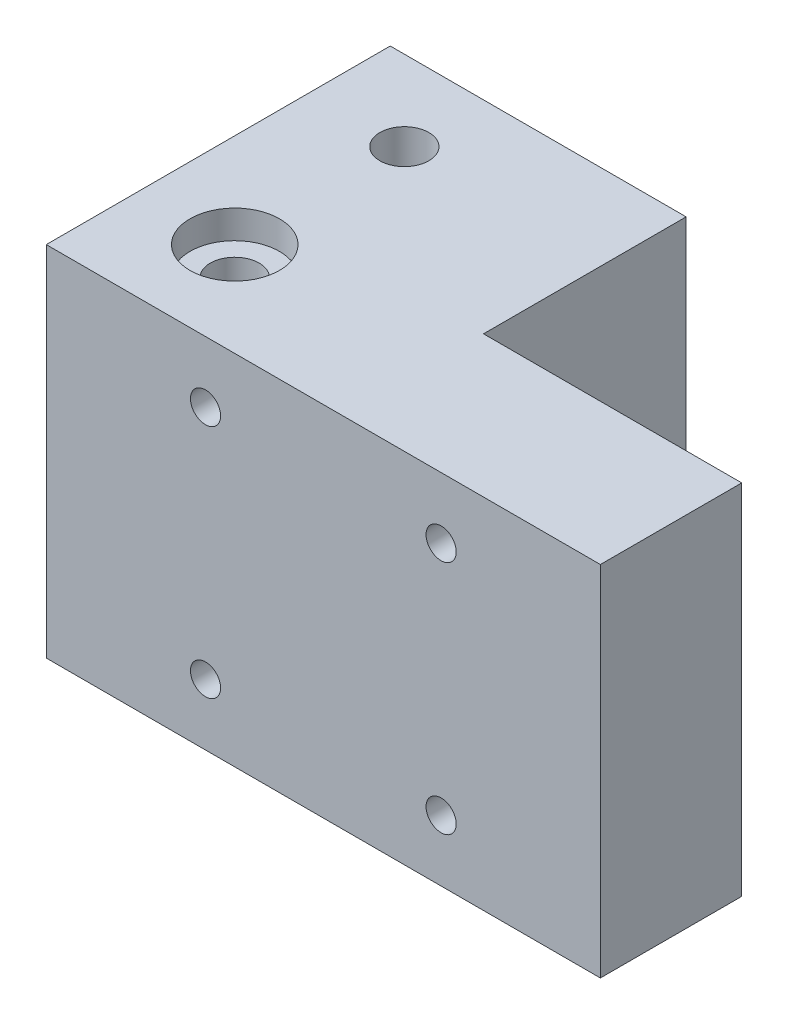
ISO-10303-21;
HEADER;
FILE_DESCRIPTION(('STEP AP214'),'2;1');
FILE_NAME('part.step','',(''),(''),'','','');
FILE_SCHEMA(('AUTOMOTIVE_DESIGN { 1 0 10303 214 1 1 1 1 }'));
ENDSEC;
DATA;
#1=APPLICATION_CONTEXT('core data for automotive mechanical design processes');
#2=APPLICATION_PROTOCOL_DEFINITION('international standard','automotive_design',2000,#1);
#3=PRODUCT_CONTEXT('',#1,'mechanical');
#4=PRODUCT('Part','Part','',(#3));
#5=PRODUCT_RELATED_PRODUCT_CATEGORY('part','',(#4));
#6=PRODUCT_DEFINITION_FORMATION('','',#4);
#7=PRODUCT_DEFINITION_CONTEXT('part definition',#1,'design');
#8=PRODUCT_DEFINITION('design','',#6,#7);
#9=PRODUCT_DEFINITION_SHAPE('','',#8);
#10=(LENGTH_UNIT() NAMED_UNIT(*) SI_UNIT(.MILLI.,.METRE.));
#11=(NAMED_UNIT(*) PLANE_ANGLE_UNIT() SI_UNIT($,.RADIAN.));
#12=(NAMED_UNIT(*) SI_UNIT($,.STERADIAN.) SOLID_ANGLE_UNIT());
#13=UNCERTAINTY_MEASURE_WITH_UNIT(LENGTH_MEASURE(1.E-05),#10,'distance_accuracy_value','');
#14=(GEOMETRIC_REPRESENTATION_CONTEXT(3) GLOBAL_UNCERTAINTY_ASSIGNED_CONTEXT((#13)) GLOBAL_UNIT_ASSIGNED_CONTEXT((#10,
#11,#12)) REPRESENTATION_CONTEXT('',''));
#15=CARTESIAN_POINT('',(0.,0.,0.));
#16=DIRECTION('',(0.,0.,1.));
#17=DIRECTION('',(1.,0.,0.));
#18=AXIS2_PLACEMENT_3D('',#15,#16,#17);
#19=CARTESIAN_POINT('',(-20.1396226415094,-15.9547169811321,31.5));
#20=DIRECTION('',(0.,1.,0.));
#21=DIRECTION('',(0.,0.,1.));
#22=AXIS2_PLACEMENT_3D('',#19,#20,#21);
#23=CYLINDRICAL_SURFACE('',#22,2.6);
#24=CARTESIAN_POINT('',(-20.1396226415094,-15.9547169811321,31.5));
#25=DIRECTION('',(0.,1.,0.));
#26=DIRECTION('',(0.,0.,1.));
#27=AXIS2_PLACEMENT_3D('',#24,#25,#26);
#28=CIRCLE('',#27,2.6);
#29=CARTESIAN_POINT('',(-20.1396226415094,-15.9547169811321,34.1));
#30=VERTEX_POINT('',#29);
#31=EDGE_CURVE('E216',#30,#30,#28,.T.);
#32=ORIENTED_EDGE('',*,*,#31,.F.);
#33=EDGE_LOOP('',(#32));
#34=FACE_BOUND('',#33,.T.);
#35=CARTESIAN_POINT('',(-20.1396226415094,19.0452830188679,31.5));
#36=DIRECTION('',(0.,1.,0.));
#37=DIRECTION('',(0.,0.,1.));
#38=AXIS2_PLACEMENT_3D('',#35,#36,#37);
#39=CIRCLE('',#38,2.6);
#40=CARTESIAN_POINT('',(-20.1396226415094,19.0452830188679,34.1));
#41=VERTEX_POINT('',#40);
#42=EDGE_CURVE('E744',#41,#41,#39,.T.);
#43=ORIENTED_EDGE('',*,*,#42,.T.);
#44=EDGE_LOOP('',(#43));
#45=FACE_BOUND('',#44,.T.);
#46=ADVANCED_FACE('F47',(#34,#45),#23,.F.);
#47=CARTESIAN_POINT('',(28.6603773584906,-5.85471698113207,13.5));
#48=DIRECTION('',(-1.,0.,0.));
#49=DIRECTION('',(0.,-1.,0.));
#50=AXIS2_PLACEMENT_3D('',#47,#48,#49);
#51=CYLINDRICAL_SURFACE('',#50,2.6);
#52=CARTESIAN_POINT('',(-10.0396226415094,-5.85471698113206,13.5));
#53=DIRECTION('',(-1.,0.,0.));
#54=DIRECTION('',(0.,-1.,0.));
#55=AXIS2_PLACEMENT_3D('',#52,#53,#54);
#56=CIRCLE('',#55,2.6);
#57=CARTESIAN_POINT('',(-10.0396226415094,-8.45471698113206,13.5));
#58=VERTEX_POINT('',#57);
#59=EDGE_CURVE('E174',#58,#58,#56,.T.);
#60=ORIENTED_EDGE('',*,*,#59,.T.);
#61=EDGE_LOOP('',(#60));
#62=FACE_BOUND('',#61,.T.);
#63=CARTESIAN_POINT('',(-3.93962264150943,-5.85471698113206,13.5));
#64=DIRECTION('',(1.,0.,0.));
#65=DIRECTION('',(0.,0.,-1.));
#66=AXIS2_PLACEMENT_3D('',#63,#64,#65);
#67=CIRCLE('',#66,2.6);
#68=CARTESIAN_POINT('',(-3.93962264150943,-5.85471698113206,10.9));
#69=VERTEX_POINT('',#68);
#70=EDGE_CURVE('E165',#69,#69,#67,.T.);
#71=ORIENTED_EDGE('',*,*,#70,.T.);
#72=EDGE_LOOP('',(#71));
#73=FACE_BOUND('',#72,.T.);
#74=ADVANCED_FACE('F344',(#62,#73),#51,.F.);
#75=CARTESIAN_POINT('',(0.,0.,22.));
#76=DIRECTION('',(0.,0.,-1.));
#77=DIRECTION('',(-1.,0.,0.));
#78=AXIS2_PLACEMENT_3D('',#75,#76,#77);
#79=PLANE('',#78);
#80=DIRECTION('',(0.,1.,0.));
#81=VECTOR('',#80,1.);
#82=CARTESIAN_POINT('',(-10.0396226415094,-1.05471698113206,22.));
#83=LINE('',#82,#81);
#84=CARTESIAN_POINT('',(-10.0396226415094,-15.9547169811321,22.));
#85=VERTEX_POINT('',#84);
#86=CARTESIAN_POINT('',(-10.0396226415094,4.14528301886794,22.));
#87=VERTEX_POINT('',#86);
#88=EDGE_CURVE('E223',#85,#87,#83,.T.);
#89=ORIENTED_EDGE('',*,*,#88,.F.);
#90=DIRECTION('',(1.,0.,0.));
#91=VECTOR('',#90,1.);
#92=CARTESIAN_POINT('',(-10.0396226415094,-15.9547169811321,22.));
#93=LINE('',#92,#91);
#94=CARTESIAN_POINT('',(-30.1396226415094,-15.9547169811321,22.));
#95=VERTEX_POINT('',#94);
#96=EDGE_CURVE('E185',#95,#85,#93,.T.);
#97=ORIENTED_EDGE('',*,*,#96,.F.);
#98=DIRECTION('',(0.,1.,0.));
#99=VECTOR('',#98,1.);
#100=CARTESIAN_POINT('',(-30.1396226415094,0.,22.));
#101=LINE('',#100,#99);
#102=CARTESIAN_POINT('',(-30.1396226415094,4.14528301886794,22.));
#103=VERTEX_POINT('',#102);
#104=EDGE_CURVE('E248',#95,#103,#101,.T.);
#105=ORIENTED_EDGE('',*,*,#104,.T.);
#106=DIRECTION('',(-1.,0.,0.));
#107=VECTOR('',#106,1.);
#108=CARTESIAN_POINT('',(-10.0396226415094,4.14528301886794,22.));
#109=LINE('',#108,#107);
#110=EDGE_CURVE('E196',#87,#103,#109,.T.);
#111=ORIENTED_EDGE('',*,*,#110,.F.);
#112=EDGE_LOOP('',(#89,#97,#105,#111));
#113=FACE_BOUND('',#112,.T.);
#114=CARTESIAN_POINT('',(-13.2396226415094,-9.45471698113206,22.));
#115=DIRECTION('',(0.,0.,1.));
#116=DIRECTION('',(1.,0.,0.));
#117=AXIS2_PLACEMENT_3D('',#114,#115,#116);
#118=CIRCLE('',#117,3.00000000000001);
#119=CARTESIAN_POINT('',(-10.2396226415094,-9.45471698113206,22.));
#120=VERTEX_POINT('',#119);
#121=EDGE_CURVE('E212',#120,#120,#118,.F.);
#122=ORIENTED_EDGE('',*,*,#121,.F.);
#123=EDGE_LOOP('',(#122));
#124=FACE_BOUND('',#123,.T.);
#125=ADVANCED_FACE('F352',(#113,#124),#79,.T.);
#126=CARTESIAN_POINT('',(-10.0396226415094,0.,0.));
#127=DIRECTION('',(-1.,0.,0.));
#128=DIRECTION('',(0.,-1.,0.));
#129=AXIS2_PLACEMENT_3D('',#126,#127,#128);
#130=PLANE('',#129);
#131=ORIENTED_EDGE('',*,*,#59,.F.);
#132=EDGE_LOOP('',(#131));
#133=FACE_BOUND('',#132,.T.);
#134=DIRECTION('',(0.,0.,1.));
#135=VECTOR('',#134,1.);
#136=CARTESIAN_POINT('',(-10.0396226415094,4.14528301886794,5.));
#137=LINE('',#136,#135);
#138=CARTESIAN_POINT('',(-10.0396226415094,4.14528301886794,5.));
#139=VERTEX_POINT('',#138);
#140=EDGE_CURVE('E193',#139,#87,#137,.T.);
#141=ORIENTED_EDGE('',*,*,#140,.F.);
#142=DIRECTION('',(0.,-1.,0.));
#143=VECTOR('',#142,1.);
#144=CARTESIAN_POINT('',(-10.0396226415094,19.0452830188679,5.));
#145=LINE('',#144,#143);
#146=CARTESIAN_POINT('',(-10.0396226415094,-15.9547169811321,5.));
#147=VERTEX_POINT('',#146);
#148=EDGE_CURVE('E220',#139,#147,#145,.T.);
#149=ORIENTED_EDGE('',*,*,#148,.T.);
#150=DIRECTION('',(0.,0.,-1.));
#151=VECTOR('',#150,1.);
#152=CARTESIAN_POINT('',(-10.0396226415094,-15.9547169811321,5.));
#153=LINE('',#152,#151);
#154=EDGE_CURVE('E181',#85,#147,#153,.T.);
#155=ORIENTED_EDGE('',*,*,#154,.F.);
#156=ORIENTED_EDGE('',*,*,#88,.T.);
#157=EDGE_LOOP('',(#141,#149,#155,#156));
#158=FACE_BOUND('',#157,.T.);
#159=ADVANCED_FACE('F361',(#133,#158),#130,.T.);
#160=CARTESIAN_POINT('',(-13.2396226415094,-9.45471698113206,0.));
#161=DIRECTION('',(0.,0.,-1.));
#162=DIRECTION('',(-1.,0.,0.));
#163=AXIS2_PLACEMENT_3D('',#160,#161,#162);
#164=CYLINDRICAL_SURFACE('',#163,3.00000000000001);
#165=CARTESIAN_POINT('',(-13.2396226415094,-9.45471698113206,32.5));
#166=DIRECTION('',(0.,0.,-1.));
#167=DIRECTION('',(-1.,0.,0.));
#168=AXIS2_PLACEMENT_3D('',#165,#166,#167);
#169=CIRCLE('',#168,3.00000000000001);
#170=CARTESIAN_POINT('',(-16.2396226415095,-9.45471698113206,32.5));
#171=VERTEX_POINT('',#170);
#172=EDGE_CURVE('E286',#171,#171,#169,.T.);
#173=ORIENTED_EDGE('',*,*,#172,.F.);
#174=EDGE_LOOP('',(#173));
#175=FACE_BOUND('',#174,.T.);
#176=ORIENTED_EDGE('',*,*,#121,.T.);
#177=EDGE_LOOP('',(#176));
#178=FACE_BOUND('',#177,.T.);
#179=ADVANCED_FACE('F364',(#175,#178),#164,.F.);
#180=CARTESIAN_POINT('',(0.,0.,5.));
#181=DIRECTION('',(0.,0.,-1.));
#182=DIRECTION('',(-1.,0.,0.));
#183=AXIS2_PLACEMENT_3D('',#180,#181,#182);
#184=PLANE('',#183);
#185=DIRECTION('',(-1.,0.,0.));
#186=VECTOR('',#185,1.);
#187=CARTESIAN_POINT('',(28.6603773584906,-15.9547169811321,5.));
#188=LINE('',#187,#186);
#189=CARTESIAN_POINT('',(1.26037735849057,-15.9547169811321,5.));
#190=VERTEX_POINT('',#189);
#191=EDGE_CURVE('E245',#190,#147,#188,.T.);
#192=ORIENTED_EDGE('',*,*,#191,.T.);
#193=ORIENTED_EDGE('',*,*,#148,.F.);
#194=DIRECTION('',(1.,0.,0.));
#195=VECTOR('',#194,1.);
#196=CARTESIAN_POINT('',(-30.1396226415094,4.14528301886794,5.));
#197=LINE('',#196,#195);
#198=CARTESIAN_POINT('',(-30.1396226415094,4.14528301886794,5.));
#199=VERTEX_POINT('',#198);
#200=EDGE_CURVE('E203',#199,#139,#197,.T.);
#201=ORIENTED_EDGE('',*,*,#200,.F.);
#202=DIRECTION('',(0.,1.,0.));
#203=VECTOR('',#202,1.);
#204=CARTESIAN_POINT('',(-30.1396226415094,19.0452830188679,5.));
#205=LINE('',#204,#203);
#206=CARTESIAN_POINT('',(-30.1396226415094,22.0452830188679,5.));
#207=VERTEX_POINT('',#206);
#208=EDGE_CURVE('E133',#199,#207,#205,.T.);
#209=ORIENTED_EDGE('',*,*,#208,.T.);
#210=DIRECTION('',(-1.,0.,0.));
#211=VECTOR('',#210,1.);
#212=CARTESIAN_POINT('',(1.26037735849057,22.0452830188679,5.));
#213=LINE('',#212,#211);
#214=CARTESIAN_POINT('',(1.26037735849057,22.0452830188679,5.));
#215=VERTEX_POINT('',#214);
#216=EDGE_CURVE('E129',#215,#207,#213,.T.);
#217=ORIENTED_EDGE('',*,*,#216,.F.);
#218=DIRECTION('',(0.,1.,0.));
#219=VECTOR('',#218,1.);
#220=CARTESIAN_POINT('',(1.26037735849057,-15.9547169811321,5.));
#221=LINE('',#220,#219);
#222=EDGE_CURVE('E116',#190,#215,#221,.T.);
#223=ORIENTED_EDGE('',*,*,#222,.F.);
#224=EDGE_LOOP('',(#192,#193,#201,#209,#217,#223));
#225=FACE_BOUND('',#224,.T.);
#226=CARTESIAN_POINT('',(-13.2396226415094,15.5452830188679,5.));
#227=DIRECTION('',(0.,0.,-1.));
#228=DIRECTION('',(-1.,0.,0.));
#229=AXIS2_PLACEMENT_3D('',#226,#227,#228);
#230=CIRCLE('',#229,3.00000000000001);
#231=CARTESIAN_POINT('',(-16.2396226415095,15.5452830188679,5.));
#232=VERTEX_POINT('',#231);
#233=EDGE_CURVE('E206',#232,#232,#230,.T.);
#234=ORIENTED_EDGE('',*,*,#233,.F.);
#235=EDGE_LOOP('',(#234));
#236=FACE_BOUND('',#235,.T.);
#237=ADVANCED_FACE('F130',(#225,#236),#184,.T.);
#238=CARTESIAN_POINT('',(-30.1396226415094,19.0452830188679,41.5));
#239=DIRECTION('',(1.,0.,0.));
#240=DIRECTION('',(0.,0.,-1.));
#241=AXIS2_PLACEMENT_3D('',#238,#239,#240);
#242=PLANE('',#241);
#243=ORIENTED_EDGE('',*,*,#104,.F.);
#244=DIRECTION('',(0.,0.,-1.));
#245=VECTOR('',#244,1.);
#246=CARTESIAN_POINT('',(-30.1396226415094,-15.9547169811321,41.5));
#247=LINE('',#246,#245);
#248=CARTESIAN_POINT('',(-30.1396226415094,-15.9547169811321,41.5));
#249=VERTEX_POINT('',#248);
#250=EDGE_CURVE('E252',#249,#95,#247,.T.);
#251=ORIENTED_EDGE('',*,*,#250,.F.);
#252=DIRECTION('',(0.,-1.,0.));
#253=VECTOR('',#252,1.);
#254=CARTESIAN_POINT('',(-30.1396226415094,19.0452830188679,41.5));
#255=LINE('',#254,#253);
#256=CARTESIAN_POINT('',(-30.1396226415094,22.0452830188679,41.5));
#257=VERTEX_POINT('',#256);
#258=EDGE_CURVE('E56',#257,#249,#255,.T.);
#259=ORIENTED_EDGE('',*,*,#258,.F.);
#260=DIRECTION('',(0.,0.,1.));
#261=VECTOR('',#260,1.);
#262=CARTESIAN_POINT('',(-30.1396226415094,22.0452830188679,5.));
#263=LINE('',#262,#261);
#264=EDGE_CURVE('E138',#207,#257,#263,.T.);
#265=ORIENTED_EDGE('',*,*,#264,.F.);
#266=ORIENTED_EDGE('',*,*,#208,.F.);
#267=DIRECTION('',(0.,0.,-1.));
#268=VECTOR('',#267,1.);
#269=CARTESIAN_POINT('',(-30.1396226415094,4.14528301886794,22.));
#270=LINE('',#269,#268);
#271=EDGE_CURVE('E199',#103,#199,#270,.T.);
#272=ORIENTED_EDGE('',*,*,#271,.F.);
#273=EDGE_LOOP('',(#243,#251,#259,#265,#266,#272));
#274=FACE_BOUND('',#273,.T.);
#275=ADVANCED_FACE('F49',(#274),#242,.F.);
#276=CARTESIAN_POINT('',(28.6603773584906,19.0452830188679,41.5));
#277=DIRECTION('',(-1.,0.,0.));
#278=DIRECTION('',(0.,-1.,0.));
#279=AXIS2_PLACEMENT_3D('',#276,#277,#278);
#280=PLANE('',#279);
#281=DIRECTION('',(0.,0.,1.));
#282=VECTOR('',#281,1.);
#283=CARTESIAN_POINT('',(28.6603773584906,-15.9547169811321,0.));
#284=LINE('',#283,#282);
#285=CARTESIAN_POINT('',(28.6603773584906,-15.9547169811321,26.5));
#286=VERTEX_POINT('',#285);
#287=CARTESIAN_POINT('',(28.6603773584906,-15.9547169811321,41.5));
#288=VERTEX_POINT('',#287);
#289=EDGE_CURVE('E256',#286,#288,#284,.T.);
#290=ORIENTED_EDGE('',*,*,#289,.F.);
#291=DIRECTION('',(0.,1.,0.));
#292=VECTOR('',#291,1.);
#293=CARTESIAN_POINT('',(28.6603773584906,-15.9547169811321,26.5));
#294=LINE('',#293,#292);
#295=CARTESIAN_POINT('',(28.6603773584906,22.0452830188679,26.5));
#296=VERTEX_POINT('',#295);
#297=EDGE_CURVE('E232',#286,#296,#294,.T.);
#298=ORIENTED_EDGE('',*,*,#297,.T.);
#299=DIRECTION('',(0.,0.,-1.));
#300=VECTOR('',#299,1.);
#301=CARTESIAN_POINT('',(28.6603773584906,22.0452830188679,41.5));
#302=LINE('',#301,#300);
#303=CARTESIAN_POINT('',(28.6603773584906,22.0452830188679,41.5));
#304=VERTEX_POINT('',#303);
#305=EDGE_CURVE('E160',#304,#296,#302,.T.);
#306=ORIENTED_EDGE('',*,*,#305,.F.);
#307=DIRECTION('',(0.,1.,0.));
#308=VECTOR('',#307,1.);
#309=CARTESIAN_POINT('',(28.6603773584906,19.0452830188679,41.5));
#310=LINE('',#309,#308);
#311=EDGE_CURVE('E12',#288,#304,#310,.T.);
#312=ORIENTED_EDGE('',*,*,#311,.F.);
#313=EDGE_LOOP('',(#290,#298,#306,#312));
#314=FACE_BOUND('',#313,.T.);
#315=ADVANCED_FACE('F330',(#314),#280,.F.);
#316=CARTESIAN_POINT('',(11.7603773584906,-9.45471698113206,0.));
#317=DIRECTION('',(0.,0.,-1.));
#318=DIRECTION('',(-1.,0.,0.));
#319=AXIS2_PLACEMENT_3D('',#316,#317,#318);
#320=CYLINDRICAL_SURFACE('',#319,3.00000000000001);
#321=CARTESIAN_POINT('',(11.7603773584906,-9.45471698113206,26.5));
#322=DIRECTION('',(0.,0.,1.));
#323=DIRECTION('',(1.,0.,0.));
#324=AXIS2_PLACEMENT_3D('',#321,#322,#323);
#325=CIRCLE('',#324,3.00000000000001);
#326=CARTESIAN_POINT('',(14.7603773584906,-9.45471698113206,26.5));
#327=VERTEX_POINT('',#326);
#328=EDGE_CURVE('E241',#327,#327,#325,.F.);
#329=ORIENTED_EDGE('',*,*,#328,.T.);
#330=EDGE_LOOP('',(#329));
#331=FACE_BOUND('',#330,.T.);
#332=CARTESIAN_POINT('',(11.7603773584906,-9.45471698113206,32.5));
#333=DIRECTION('',(0.,0.,-1.));
#334=DIRECTION('',(-1.,0.,0.));
#335=AXIS2_PLACEMENT_3D('',#332,#333,#334);
#336=CIRCLE('',#335,3.00000000000001);
#337=CARTESIAN_POINT('',(8.76037735849055,-9.45471698113206,32.5));
#338=VERTEX_POINT('',#337);
#339=EDGE_CURVE('E298',#338,#338,#336,.T.);
#340=ORIENTED_EDGE('',*,*,#339,.F.);
#341=EDGE_LOOP('',(#340));
#342=FACE_BOUND('',#341,.T.);
#343=ADVANCED_FACE('F327',(#331,#342),#320,.F.);
#344=CARTESIAN_POINT('',(11.7603773584906,15.5452830188679,0.));
#345=DIRECTION('',(0.,0.,-1.));
#346=DIRECTION('',(-1.,0.,0.));
#347=AXIS2_PLACEMENT_3D('',#344,#345,#346);
#348=CYLINDRICAL_SURFACE('',#347,3.00000000000001);
#349=CARTESIAN_POINT('',(11.7603773584906,15.5452830188679,26.5));
#350=DIRECTION('',(0.,0.,1.));
#351=DIRECTION('',(1.,0.,0.));
#352=AXIS2_PLACEMENT_3D('',#349,#350,#351);
#353=CIRCLE('',#352,3.00000000000001);
#354=CARTESIAN_POINT('',(14.7603773584906,15.5452830188679,26.5));
#355=VERTEX_POINT('',#354);
#356=EDGE_CURVE('E235',#355,#355,#353,.F.);
#357=ORIENTED_EDGE('',*,*,#356,.T.);
#358=EDGE_LOOP('',(#357));
#359=FACE_BOUND('',#358,.T.);
#360=CARTESIAN_POINT('',(11.7603773584906,15.5452830188679,32.5));
#361=DIRECTION('',(0.,0.,-1.));
#362=DIRECTION('',(-1.,0.,0.));
#363=AXIS2_PLACEMENT_3D('',#360,#361,#362);
#364=CIRCLE('',#363,3.00000000000001);
#365=CARTESIAN_POINT('',(8.76037735849055,15.5452830188679,32.5));
#366=VERTEX_POINT('',#365);
#367=EDGE_CURVE('E262',#366,#366,#364,.T.);
#368=ORIENTED_EDGE('',*,*,#367,.F.);
#369=EDGE_LOOP('',(#368));
#370=FACE_BOUND('',#369,.T.);
#371=ADVANCED_FACE('F329',(#359,#370),#348,.F.);
#372=CARTESIAN_POINT('',(0.,-15.9547169811321,0.));
#373=DIRECTION('',(0.,-1.,0.));
#374=DIRECTION('',(0.,0.,-1.));
#375=AXIS2_PLACEMENT_3D('',#372,#373,#374);
#376=PLANE('',#375);
#377=ORIENTED_EDGE('',*,*,#154,.T.);
#378=ORIENTED_EDGE('',*,*,#191,.F.);
#379=DIRECTION('',(0.,0.,1.));
#380=VECTOR('',#379,1.);
#381=CARTESIAN_POINT('',(1.26037735849057,-15.9547169811321,26.5));
#382=LINE('',#381,#380);
#383=CARTESIAN_POINT('',(1.26037735849057,-15.9547169811321,26.5));
#384=VERTEX_POINT('',#383);
#385=EDGE_CURVE('E63',#190,#384,#382,.T.);
#386=ORIENTED_EDGE('',*,*,#385,.T.);
#387=DIRECTION('',(1.,0.,0.));
#388=VECTOR('',#387,1.);
#389=CARTESIAN_POINT('',(1.26037735849057,-15.9547169811321,26.5));
#390=LINE('',#389,#388);
#391=EDGE_CURVE('E126',#384,#286,#390,.T.);
#392=ORIENTED_EDGE('',*,*,#391,.T.);
#393=ORIENTED_EDGE('',*,*,#289,.T.);
#394=DIRECTION('',(-1.,0.,0.));
#395=VECTOR('',#394,1.);
#396=CARTESIAN_POINT('',(28.6603773584906,-15.9547169811321,41.5));
#397=LINE('',#396,#395);
#398=EDGE_CURVE('E259',#288,#249,#397,.T.);
#399=ORIENTED_EDGE('',*,*,#398,.T.);
#400=ORIENTED_EDGE('',*,*,#250,.T.);
#401=ORIENTED_EDGE('',*,*,#96,.T.);
#402=EDGE_LOOP('',(#377,#378,#386,#392,#393,#399,#400,#401));
#403=FACE_BOUND('',#402,.T.);
#404=ORIENTED_EDGE('',*,*,#31,.T.);
#405=EDGE_LOOP('',(#404));
#406=FACE_BOUND('',#405,.T.);
#407=ADVANCED_FACE('F337',(#403,#406),#376,.T.);
#408=CARTESIAN_POINT('',(-13.2396226415094,15.5452830188679,0.));
#409=DIRECTION('',(0.,0.,-1.));
#410=DIRECTION('',(-1.,0.,0.));
#411=AXIS2_PLACEMENT_3D('',#408,#409,#410);
#412=CYLINDRICAL_SURFACE('',#411,3.00000000000001);
#413=CARTESIAN_POINT('',(-13.2396226415094,15.5452830188679,32.5));
#414=DIRECTION('',(0.,0.,-1.));
#415=DIRECTION('',(-1.,0.,0.));
#416=AXIS2_PLACEMENT_3D('',#413,#414,#415);
#417=CIRCLE('',#416,3.00000000000001);
#418=CARTESIAN_POINT('',(-16.2396226415095,15.5452830188679,32.5));
#419=VERTEX_POINT('',#418);
#420=EDGE_CURVE('E274',#419,#419,#417,.T.);
#421=ORIENTED_EDGE('',*,*,#420,.F.);
#422=EDGE_LOOP('',(#421));
#423=FACE_BOUND('',#422,.T.);
#424=ORIENTED_EDGE('',*,*,#233,.T.);
#425=EDGE_LOOP('',(#424));
#426=FACE_BOUND('',#425,.T.);
#427=ADVANCED_FACE('F379',(#423,#426),#412,.F.);
#428=CARTESIAN_POINT('',(0.,0.,41.5));
#429=DIRECTION('',(0.,0.,1.));
#430=DIRECTION('',(1.,0.,0.));
#431=AXIS2_PLACEMENT_3D('',#428,#429,#430);
#432=PLANE('',#431);
#433=CARTESIAN_POINT('',(11.7603773584906,15.5452830188679,41.5));
#434=DIRECTION('',(0.,0.,-1.));
#435=DIRECTION('',(-1.,0.,0.));
#436=AXIS2_PLACEMENT_3D('',#433,#434,#435);
#437=CIRCLE('',#436,1.60000000000001);
#438=CARTESIAN_POINT('',(10.1603773584905,15.5452830188679,41.5));
#439=VERTEX_POINT('',#438);
#440=EDGE_CURVE('E270',#439,#439,#437,.T.);
#441=ORIENTED_EDGE('',*,*,#440,.T.);
#442=EDGE_LOOP('',(#441));
#443=FACE_BOUND('',#442,.T.);
#444=CARTESIAN_POINT('',(-13.2396226415094,15.5452830188679,41.5));
#445=DIRECTION('',(0.,0.,-1.));
#446=DIRECTION('',(-1.,0.,0.));
#447=AXIS2_PLACEMENT_3D('',#444,#445,#446);
#448=CIRCLE('',#447,1.60000000000001);
#449=CARTESIAN_POINT('',(-14.8396226415095,15.5452830188679,41.5));
#450=VERTEX_POINT('',#449);
#451=EDGE_CURVE('E282',#450,#450,#448,.T.);
#452=ORIENTED_EDGE('',*,*,#451,.T.);
#453=EDGE_LOOP('',(#452));
#454=FACE_BOUND('',#453,.T.);
#455=CARTESIAN_POINT('',(-13.2396226415094,-9.45471698113206,41.5));
#456=DIRECTION('',(0.,0.,-1.));
#457=DIRECTION('',(-1.,0.,0.));
#458=AXIS2_PLACEMENT_3D('',#455,#456,#457);
#459=CIRCLE('',#458,1.60000000000001);
#460=CARTESIAN_POINT('',(-14.8396226415095,-9.45471698113206,41.5));
#461=VERTEX_POINT('',#460);
#462=EDGE_CURVE('E294',#461,#461,#459,.T.);
#463=ORIENTED_EDGE('',*,*,#462,.T.);
#464=EDGE_LOOP('',(#463));
#465=FACE_BOUND('',#464,.T.);
#466=CARTESIAN_POINT('',(11.7603773584906,-9.45471698113206,41.5));
#467=DIRECTION('',(0.,0.,-1.));
#468=DIRECTION('',(-1.,0.,0.));
#469=AXIS2_PLACEMENT_3D('',#466,#467,#468);
#470=CIRCLE('',#469,1.60000000000001);
#471=CARTESIAN_POINT('',(10.1603773584905,-9.45471698113206,41.5));
#472=VERTEX_POINT('',#471);
#473=EDGE_CURVE('E306',#472,#472,#470,.T.);
#474=ORIENTED_EDGE('',*,*,#473,.T.);
#475=EDGE_LOOP('',(#474));
#476=FACE_BOUND('',#475,.T.);
#477=ORIENTED_EDGE('',*,*,#258,.T.);
#478=ORIENTED_EDGE('',*,*,#398,.F.);
#479=ORIENTED_EDGE('',*,*,#311,.T.);
#480=DIRECTION('',(1.,0.,0.));
#481=VECTOR('',#480,1.);
#482=CARTESIAN_POINT('',(-30.1396226415094,22.0452830188679,41.5));
#483=LINE('',#482,#481);
#484=EDGE_CURVE('E156',#257,#304,#483,.T.);
#485=ORIENTED_EDGE('',*,*,#484,.F.);
#486=EDGE_LOOP('',(#477,#478,#479,#485));
#487=FACE_BOUND('',#486,.T.);
#488=ADVANCED_FACE('F312',(#443,#454,#465,#476,#487),#432,.T.);
#489=CARTESIAN_POINT('',(11.7603773584906,-9.45471698113206,0.));
#490=DIRECTION('',(0.,0.,-1.));
#491=DIRECTION('',(-1.,0.,0.));
#492=AXIS2_PLACEMENT_3D('',#489,#490,#491);
#493=CYLINDRICAL_SURFACE('',#492,1.60000000000001);
#494=ORIENTED_EDGE('',*,*,#473,.F.);
#495=EDGE_LOOP('',(#494));
#496=FACE_BOUND('',#495,.T.);
#497=CARTESIAN_POINT('',(11.7603773584906,-9.45471698113206,32.5));
#498=DIRECTION('',(0.,0.,-1.));
#499=DIRECTION('',(-1.,0.,0.));
#500=AXIS2_PLACEMENT_3D('',#497,#498,#499);
#501=CIRCLE('',#500,1.60000000000001);
#502=CARTESIAN_POINT('',(10.1603773584906,-9.45471698113206,32.5));
#503=VERTEX_POINT('',#502);
#504=EDGE_CURVE('E302',#503,#503,#501,.T.);
#505=ORIENTED_EDGE('',*,*,#504,.T.);
#506=EDGE_LOOP('',(#505));
#507=FACE_BOUND('',#506,.T.);
#508=ADVANCED_FACE('F314',(#496,#507),#493,.F.);
#509=CARTESIAN_POINT('',(13.3603773584906,-9.45471698113206,32.5));
#510=DIRECTION('',(0.,0.,1.));
#511=DIRECTION('',(1.,0.,0.));
#512=AXIS2_PLACEMENT_3D('',#509,#510,#511);
#513=PLANE('',#512);
#514=ORIENTED_EDGE('',*,*,#504,.F.);
#515=EDGE_LOOP('',(#514));
#516=FACE_BOUND('',#515,.T.);
#517=ORIENTED_EDGE('',*,*,#339,.T.);
#518=EDGE_LOOP('',(#517));
#519=FACE_BOUND('',#518,.T.);
#520=ADVANCED_FACE('F317',(#516,#519),#513,.F.);
#521=CARTESIAN_POINT('',(-13.2396226415094,-9.45471698113206,0.));
#522=DIRECTION('',(0.,0.,-1.));
#523=DIRECTION('',(-1.,0.,0.));
#524=AXIS2_PLACEMENT_3D('',#521,#522,#523);
#525=CYLINDRICAL_SURFACE('',#524,1.60000000000001);
#526=ORIENTED_EDGE('',*,*,#462,.F.);
#527=EDGE_LOOP('',(#526));
#528=FACE_BOUND('',#527,.T.);
#529=CARTESIAN_POINT('',(-13.2396226415094,-9.45471698113206,32.5));
#530=DIRECTION('',(0.,0.,-1.));
#531=DIRECTION('',(-1.,0.,0.));
#532=AXIS2_PLACEMENT_3D('',#529,#530,#531);
#533=CIRCLE('',#532,1.60000000000001);
#534=CARTESIAN_POINT('',(-14.8396226415095,-9.45471698113206,32.5));
#535=VERTEX_POINT('',#534);
#536=EDGE_CURVE('E290',#535,#535,#533,.T.);
#537=ORIENTED_EDGE('',*,*,#536,.T.);
#538=EDGE_LOOP('',(#537));
#539=FACE_BOUND('',#538,.T.);
#540=ADVANCED_FACE('F323',(#528,#539),#525,.F.);
#541=CARTESIAN_POINT('',(-11.6396226415094,-9.45471698113206,32.5));
#542=DIRECTION('',(0.,0.,1.));
#543=DIRECTION('',(1.,0.,0.));
#544=AXIS2_PLACEMENT_3D('',#541,#542,#543);
#545=PLANE('',#544);
#546=ORIENTED_EDGE('',*,*,#536,.F.);
#547=EDGE_LOOP('',(#546));
#548=FACE_BOUND('',#547,.T.);
#549=ORIENTED_EDGE('',*,*,#172,.T.);
#550=EDGE_LOOP('',(#549));
#551=FACE_BOUND('',#550,.T.);
#552=ADVANCED_FACE('F399',(#548,#551),#545,.F.);
#553=CARTESIAN_POINT('',(-13.2396226415094,15.5452830188679,0.));
#554=DIRECTION('',(0.,0.,-1.));
#555=DIRECTION('',(-1.,0.,0.));
#556=AXIS2_PLACEMENT_3D('',#553,#554,#555);
#557=CYLINDRICAL_SURFACE('',#556,1.60000000000001);
#558=ORIENTED_EDGE('',*,*,#451,.F.);
#559=EDGE_LOOP('',(#558));
#560=FACE_BOUND('',#559,.T.);
#561=CARTESIAN_POINT('',(-13.2396226415094,15.5452830188679,32.5));
#562=DIRECTION('',(0.,0.,-1.));
#563=DIRECTION('',(-1.,0.,0.));
#564=AXIS2_PLACEMENT_3D('',#561,#562,#563);
#565=CIRCLE('',#564,1.60000000000001);
#566=CARTESIAN_POINT('',(-14.8396226415095,15.5452830188679,32.5));
#567=VERTEX_POINT('',#566);
#568=EDGE_CURVE('E278',#567,#567,#565,.T.);
#569=ORIENTED_EDGE('',*,*,#568,.T.);
#570=EDGE_LOOP('',(#569));
#571=FACE_BOUND('',#570,.T.);
#572=ADVANCED_FACE('F395',(#560,#571),#557,.F.);
#573=CARTESIAN_POINT('',(-11.6396226415094,15.5452830188679,32.5));
#574=DIRECTION('',(0.,0.,1.));
#575=DIRECTION('',(1.,0.,0.));
#576=AXIS2_PLACEMENT_3D('',#573,#574,#575);
#577=PLANE('',#576);
#578=ORIENTED_EDGE('',*,*,#568,.F.);
#579=EDGE_LOOP('',(#578));
#580=FACE_BOUND('',#579,.T.);
#581=ORIENTED_EDGE('',*,*,#420,.T.);
#582=EDGE_LOOP('',(#581));
#583=FACE_BOUND('',#582,.T.);
#584=ADVANCED_FACE('F388',(#580,#583),#577,.F.);
#585=CARTESIAN_POINT('',(11.7603773584906,15.5452830188679,0.));
#586=DIRECTION('',(0.,0.,-1.));
#587=DIRECTION('',(-1.,0.,0.));
#588=AXIS2_PLACEMENT_3D('',#585,#586,#587);
#589=CYLINDRICAL_SURFACE('',#588,1.60000000000001);
#590=ORIENTED_EDGE('',*,*,#440,.F.);
#591=EDGE_LOOP('',(#590));
#592=FACE_BOUND('',#591,.T.);
#593=CARTESIAN_POINT('',(11.7603773584906,15.5452830188679,32.5));
#594=DIRECTION('',(0.,0.,-1.));
#595=DIRECTION('',(-1.,0.,0.));
#596=AXIS2_PLACEMENT_3D('',#593,#594,#595);
#597=CIRCLE('',#596,1.60000000000001);
#598=CARTESIAN_POINT('',(10.1603773584906,15.5452830188679,32.5));
#599=VERTEX_POINT('',#598);
#600=EDGE_CURVE('E266',#599,#599,#597,.T.);
#601=ORIENTED_EDGE('',*,*,#600,.T.);
#602=EDGE_LOOP('',(#601));
#603=FACE_BOUND('',#602,.T.);
#604=ADVANCED_FACE('F384',(#592,#603),#589,.F.);
#605=CARTESIAN_POINT('',(13.3603773584906,15.5452830188679,32.5));
#606=DIRECTION('',(0.,0.,1.));
#607=DIRECTION('',(1.,0.,0.));
#608=AXIS2_PLACEMENT_3D('',#605,#606,#607);
#609=PLANE('',#608);
#610=ORIENTED_EDGE('',*,*,#600,.F.);
#611=EDGE_LOOP('',(#610));
#612=FACE_BOUND('',#611,.T.);
#613=ORIENTED_EDGE('',*,*,#367,.T.);
#614=EDGE_LOOP('',(#613));
#615=FACE_BOUND('',#614,.T.);
#616=ADVANCED_FACE('F369',(#612,#615),#609,.F.);
#617=CARTESIAN_POINT('',(1.26037735849057,-15.9547169811321,26.5));
#618=DIRECTION('',(0.,0.,1.));
#619=DIRECTION('',(1.,0.,0.));
#620=AXIS2_PLACEMENT_3D('',#617,#618,#619);
#621=PLANE('',#620);
#622=ORIENTED_EDGE('',*,*,#356,.F.);
#623=EDGE_LOOP('',(#622));
#624=FACE_BOUND('',#623,.T.);
#625=DIRECTION('',(0.,1.,0.));
#626=VECTOR('',#625,1.);
#627=CARTESIAN_POINT('',(1.26037735849057,-15.9547169811321,26.5));
#628=LINE('',#627,#626);
#629=CARTESIAN_POINT('',(1.26037735849057,22.0452830188679,26.5));
#630=VERTEX_POINT('',#629);
#631=EDGE_CURVE('E125',#384,#630,#628,.T.);
#632=ORIENTED_EDGE('',*,*,#631,.T.);
#633=DIRECTION('',(-1.,0.,0.));
#634=VECTOR('',#633,1.);
#635=CARTESIAN_POINT('',(28.6603773584906,22.0452830188679,26.5));
#636=LINE('',#635,#634);
#637=EDGE_CURVE('E144',#296,#630,#636,.T.);
#638=ORIENTED_EDGE('',*,*,#637,.F.);
#639=ORIENTED_EDGE('',*,*,#297,.F.);
#640=ORIENTED_EDGE('',*,*,#391,.F.);
#641=EDGE_LOOP('',(#632,#638,#639,#640));
#642=FACE_BOUND('',#641,.T.);
#643=ORIENTED_EDGE('',*,*,#328,.F.);
#644=EDGE_LOOP('',(#643));
#645=FACE_BOUND('',#644,.T.);
#646=ADVANCED_FACE('F366',(#624,#642,#645),#621,.F.);
#647=CARTESIAN_POINT('',(1.26037735849057,-15.9547169811321,26.5));
#648=DIRECTION('',(-1.,0.,0.));
#649=DIRECTION('',(0.,0.,1.));
#650=AXIS2_PLACEMENT_3D('',#647,#648,#649);
#651=PLANE('',#650);
#652=CARTESIAN_POINT('',(1.26037735849057,-5.85471698113206,13.5));
#653=DIRECTION('',(1.,0.,0.));
#654=DIRECTION('',(0.,0.,-1.));
#655=AXIS2_PLACEMENT_3D('',#652,#653,#654);
#656=CIRCLE('',#655,4.5);
#657=CARTESIAN_POINT('',(1.26037735849057,-5.85471698113206,9.));
#658=VERTEX_POINT('',#657);
#659=EDGE_CURVE('E169',#658,#658,#656,.T.);
#660=ORIENTED_EDGE('',*,*,#659,.F.);
#661=EDGE_LOOP('',(#660));
#662=FACE_BOUND('',#661,.T.);
#663=ORIENTED_EDGE('',*,*,#222,.T.);
#664=DIRECTION('',(0.,0.,-1.));
#665=VECTOR('',#664,1.);
#666=CARTESIAN_POINT('',(1.26037735849057,22.0452830188679,26.5));
#667=LINE('',#666,#665);
#668=EDGE_CURVE('E120',#630,#215,#667,.T.);
#669=ORIENTED_EDGE('',*,*,#668,.F.);
#670=ORIENTED_EDGE('',*,*,#631,.F.);
#671=ORIENTED_EDGE('',*,*,#385,.F.);
#672=EDGE_LOOP('',(#663,#669,#670,#671));
#673=FACE_BOUND('',#672,.T.);
#674=ADVANCED_FACE('F118',(#662,#673),#651,.F.);
#675=CARTESIAN_POINT('',(-20.1396226415094,19.0452830188679,13.5));
#676=DIRECTION('',(0.,-1.,0.));
#677=DIRECTION('',(0.,0.,-1.));
#678=AXIS2_PLACEMENT_3D('',#675,#676,#677);
#679=CYLINDRICAL_SURFACE('',#678,2.6);
#680=CARTESIAN_POINT('',(-20.1396226415094,4.14528301886794,13.5));
#681=DIRECTION('',(0.,-1.,0.));
#682=DIRECTION('',(0.,0.,-1.));
#683=AXIS2_PLACEMENT_3D('',#680,#681,#682);
#684=CIRCLE('',#683,2.6);
#685=CARTESIAN_POINT('',(-20.1396226415094,4.14528301886794,10.9));
#686=VERTEX_POINT('',#685);
#687=EDGE_CURVE('E189',#686,#686,#684,.T.);
#688=ORIENTED_EDGE('',*,*,#687,.T.);
#689=EDGE_LOOP('',(#688));
#690=FACE_BOUND('',#689,.T.);
#691=CARTESIAN_POINT('',(-20.1396226415094,22.0452830188679,13.5));
#692=DIRECTION('',(0.,1.,0.));
#693=DIRECTION('',(0.,0.,1.));
#694=AXIS2_PLACEMENT_3D('',#691,#692,#693);
#695=CIRCLE('',#694,2.6);
#696=CARTESIAN_POINT('',(-20.1396226415094,22.0452830188679,16.1));
#697=VERTEX_POINT('',#696);
#698=EDGE_CURVE('E146',#697,#697,#695,.T.);
#699=ORIENTED_EDGE('',*,*,#698,.T.);
#700=EDGE_LOOP('',(#699));
#701=FACE_BOUND('',#700,.T.);
#702=ADVANCED_FACE('F359',(#690,#701),#679,.F.);
#703=CARTESIAN_POINT('',(0.,4.14528301886794,0.));
#704=DIRECTION('',(0.,-1.,0.));
#705=DIRECTION('',(0.,0.,-1.));
#706=AXIS2_PLACEMENT_3D('',#703,#704,#705);
#707=PLANE('',#706);
#708=ORIENTED_EDGE('',*,*,#140,.T.);
#709=ORIENTED_EDGE('',*,*,#110,.T.);
#710=ORIENTED_EDGE('',*,*,#271,.T.);
#711=ORIENTED_EDGE('',*,*,#200,.T.);
#712=EDGE_LOOP('',(#708,#709,#710,#711));
#713=FACE_BOUND('',#712,.T.);
#714=ORIENTED_EDGE('',*,*,#687,.F.);
#715=EDGE_LOOP('',(#714));
#716=FACE_BOUND('',#715,.T.);
#717=ADVANCED_FACE('F455',(#713,#716),#707,.T.);
#718=CARTESIAN_POINT('',(-3.93962264150943,-5.85471698113206,13.5));
#719=DIRECTION('',(1.,0.,0.));
#720=DIRECTION('',(0.,0.,-1.));
#721=AXIS2_PLACEMENT_3D('',#718,#719,#720);
#722=CYLINDRICAL_SURFACE('',#721,4.5);
#723=CARTESIAN_POINT('',(-3.93962264150943,-5.85471698113206,13.5));
#724=DIRECTION('',(1.,0.,0.));
#725=DIRECTION('',(0.,0.,-1.));
#726=AXIS2_PLACEMENT_3D('',#723,#724,#725);
#727=CIRCLE('',#726,4.5);
#728=CARTESIAN_POINT('',(-3.93962264150943,-5.85471698113206,9.));
#729=VERTEX_POINT('',#728);
#730=EDGE_CURVE('E170',#729,#729,#727,.T.);
#731=ORIENTED_EDGE('',*,*,#730,.F.);
#732=EDGE_LOOP('',(#731));
#733=FACE_BOUND('',#732,.T.);
#734=ORIENTED_EDGE('',*,*,#659,.T.);
#735=EDGE_LOOP('',(#734));
#736=FACE_BOUND('',#735,.T.);
#737=ADVANCED_FACE('F557',(#733,#736),#722,.F.);
#738=CARTESIAN_POINT('',(-3.93962264150943,-5.85471698113206,13.5));
#739=DIRECTION('',(1.,0.,0.));
#740=DIRECTION('',(0.,0.,-1.));
#741=AXIS2_PLACEMENT_3D('',#738,#739,#740);
#742=PLANE('',#741);
#743=ORIENTED_EDGE('',*,*,#70,.F.);
#744=EDGE_LOOP('',(#743));
#745=FACE_BOUND('',#744,.T.);
#746=ORIENTED_EDGE('',*,*,#730,.T.);
#747=EDGE_LOOP('',(#746));
#748=FACE_BOUND('',#747,.T.);
#749=ADVANCED_FACE('F463',(#745,#748),#742,.T.);
#750=CARTESIAN_POINT('',(0.,22.0452830188679,0.));
#751=DIRECTION('',(0.,1.,0.));
#752=DIRECTION('',(0.,0.,1.));
#753=AXIS2_PLACEMENT_3D('',#750,#751,#752);
#754=PLANE('',#753);
#755=CARTESIAN_POINT('',(-20.1396226415094,22.0452830188679,31.5));
#756=DIRECTION('',(0.,1.,0.));
#757=DIRECTION('',(0.,0.,1.));
#758=AXIS2_PLACEMENT_3D('',#755,#756,#757);
#759=CIRCLE('',#758,4.75);
#760=CARTESIAN_POINT('',(-20.1396226415094,22.0452830188679,36.25));
#761=VERTEX_POINT('',#760);
#762=EDGE_CURVE('E748',#761,#761,#759,.T.);
#763=ORIENTED_EDGE('',*,*,#762,.F.);
#764=EDGE_LOOP('',(#763));
#765=FACE_BOUND('',#764,.T.);
#766=ORIENTED_EDGE('',*,*,#698,.F.);
#767=EDGE_LOOP('',(#766));
#768=FACE_BOUND('',#767,.T.);
#769=ORIENTED_EDGE('',*,*,#668,.T.);
#770=ORIENTED_EDGE('',*,*,#216,.T.);
#771=ORIENTED_EDGE('',*,*,#264,.T.);
#772=ORIENTED_EDGE('',*,*,#484,.T.);
#773=ORIENTED_EDGE('',*,*,#305,.T.);
#774=ORIENTED_EDGE('',*,*,#637,.T.);
#775=EDGE_LOOP('',(#769,#770,#771,#772,#773,#774));
#776=FACE_BOUND('',#775,.T.);
#777=ADVANCED_FACE('F141',(#765,#768,#776),#754,.T.);
#778=CARTESIAN_POINT('',(-20.1396226415094,19.0452830188679,31.5));
#779=DIRECTION('',(0.,1.,0.));
#780=DIRECTION('',(0.,0.,1.));
#781=AXIS2_PLACEMENT_3D('',#778,#779,#780);
#782=CYLINDRICAL_SURFACE('',#781,4.75);
#783=CARTESIAN_POINT('',(-20.1396226415094,19.0452830188679,31.5));
#784=DIRECTION('',(0.,1.,0.));
#785=DIRECTION('',(0.,0.,1.));
#786=AXIS2_PLACEMENT_3D('',#783,#784,#785);
#787=CIRCLE('',#786,4.75);
#788=CARTESIAN_POINT('',(-20.1396226415094,19.0452830188679,36.25));
#789=VERTEX_POINT('',#788);
#790=EDGE_CURVE('E150',#789,#789,#787,.T.);
#791=ORIENTED_EDGE('',*,*,#790,.F.);
#792=EDGE_LOOP('',(#791));
#793=FACE_BOUND('',#792,.T.);
#794=ORIENTED_EDGE('',*,*,#762,.T.);
#795=EDGE_LOOP('',(#794));
#796=FACE_BOUND('',#795,.T.);
#797=ADVANCED_FACE('F462',(#793,#796),#782,.F.);
#798=CARTESIAN_POINT('',(-20.1396226415094,19.0452830188679,31.5));
#799=DIRECTION('',(0.,1.,0.));
#800=DIRECTION('',(0.,0.,1.));
#801=AXIS2_PLACEMENT_3D('',#798,#799,#800);
#802=PLANE('',#801);
#803=ORIENTED_EDGE('',*,*,#42,.F.);
#804=EDGE_LOOP('',(#803));
#805=FACE_BOUND('',#804,.T.);
#806=ORIENTED_EDGE('',*,*,#790,.T.);
#807=EDGE_LOOP('',(#806));
#808=FACE_BOUND('',#807,.T.);
#809=ADVANCED_FACE('F471',(#805,#808),#802,.T.);
#810=CLOSED_SHELL('',(#46,#74,#125,#159,#179,#237,#275,#315,#343,#371,#407,#427,#488,#508,#520,
#540,#552,#572,#584,#604,#616,#646,#674,#702,#717,#737,#749,#777,#797,#809));
#811=MANIFOLD_SOLID_BREP('B2',#810);
#812=ADVANCED_BREP_SHAPE_REPRESENTATION('',(#18,#811),#14);
#813=SHAPE_DEFINITION_REPRESENTATION(#9,#812);
ENDSEC;
END-ISO-10303-21;
